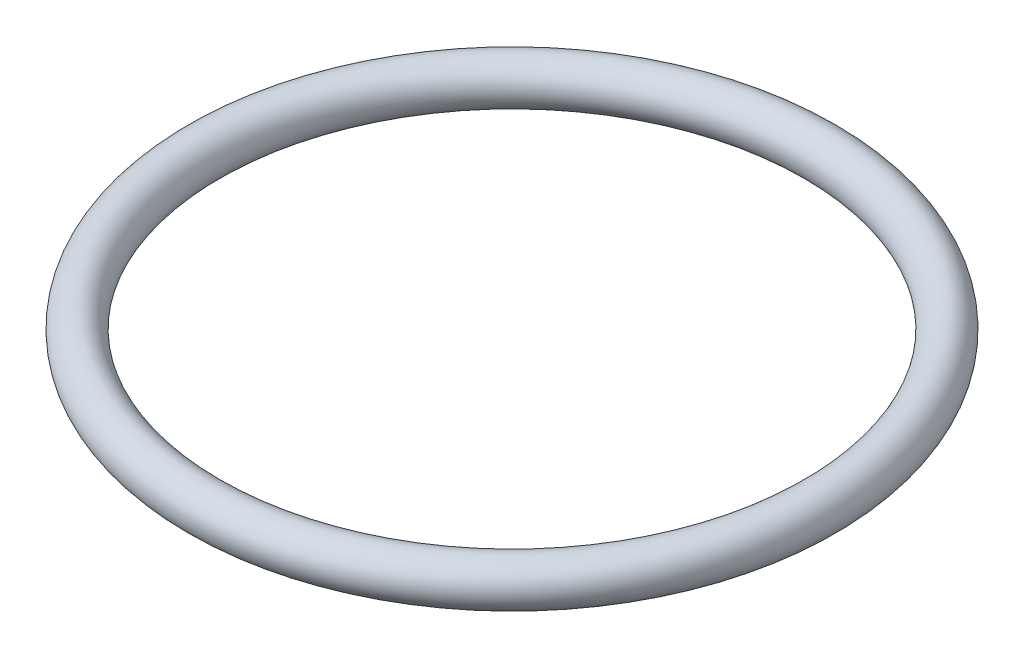
ISO-10303-21;
HEADER;
FILE_DESCRIPTION(('STEP AP214'),'2;1');
FILE_NAME('part.step','',(''),(''),'','','');
FILE_SCHEMA(('AUTOMOTIVE_DESIGN { 1 0 10303 214 1 1 1 1 }'));
ENDSEC;
DATA;
#1=APPLICATION_CONTEXT('core data for automotive mechanical design processes');
#2=APPLICATION_PROTOCOL_DEFINITION('international standard','automotive_design',2000,#1);
#3=PRODUCT_CONTEXT('',#1,'mechanical');
#4=PRODUCT('Part','Part','',(#3));
#5=PRODUCT_RELATED_PRODUCT_CATEGORY('part','',(#4));
#6=PRODUCT_DEFINITION_FORMATION('','',#4);
#7=PRODUCT_DEFINITION_CONTEXT('part definition',#1,'design');
#8=PRODUCT_DEFINITION('design','',#6,#7);
#9=PRODUCT_DEFINITION_SHAPE('','',#8);
#10=(LENGTH_UNIT() NAMED_UNIT(*) SI_UNIT(.MILLI.,.METRE.));
#11=(NAMED_UNIT(*) PLANE_ANGLE_UNIT() SI_UNIT($,.RADIAN.));
#12=(NAMED_UNIT(*) SI_UNIT($,.STERADIAN.) SOLID_ANGLE_UNIT());
#13=UNCERTAINTY_MEASURE_WITH_UNIT(LENGTH_MEASURE(1.E-05),#10,'distance_accuracy_value','');
#14=(GEOMETRIC_REPRESENTATION_CONTEXT(3) GLOBAL_UNCERTAINTY_ASSIGNED_CONTEXT((#13)) GLOBAL_UNIT_ASSIGNED_CONTEXT((#10,
#11,#12)) REPRESENTATION_CONTEXT('',''));
#15=CARTESIAN_POINT('',(0.,0.,0.));
#16=DIRECTION('',(0.,0.,1.));
#17=DIRECTION('',(1.,0.,0.));
#18=AXIS2_PLACEMENT_3D('',#15,#16,#17);
#19=CARTESIAN_POINT('',(0.,0.,0.));
#20=DIRECTION('',(0.,1.,0.));
#21=DIRECTION('',(0.,0.,1.));
#22=AXIS2_PLACEMENT_3D('',#19,#20,#21);
#23=TOROIDAL_SURFACE('',#22,21.,1.5);
#24=CARTESIAN_POINT('',(0.,0.,22.5));
#25=VERTEX_POINT('',#24);
#26=VERTEX_LOOP('',#25);
#27=FACE_BOUND('',#26,.T.);
#28=ADVANCED_FACE('F33',(#27),#23,.T.);
#29=CLOSED_SHELL('',(#28));
#30=MANIFOLD_SOLID_BREP('B2',#29);
#31=ADVANCED_BREP_SHAPE_REPRESENTATION('',(#18,#30),#14);
#32=SHAPE_DEFINITION_REPRESENTATION(#9,#31);
ENDSEC;
END-ISO-10303-21;
